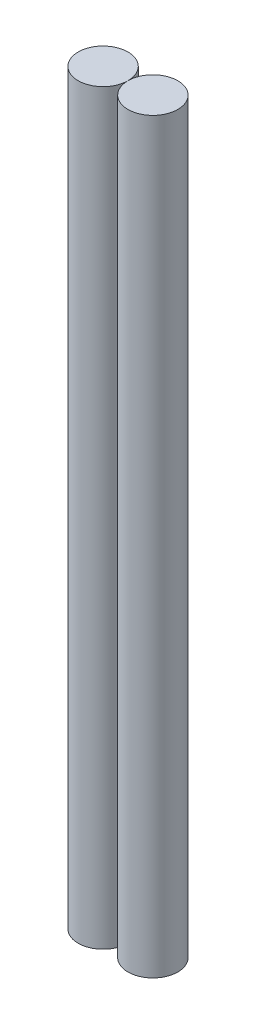
ISO-10303-21;
HEADER;
FILE_DESCRIPTION(('STEP AP214'),'2;1');
FILE_NAME('part.step','',(''),(''),'','','');
FILE_SCHEMA(('AUTOMOTIVE_DESIGN { 1 0 10303 214 1 1 1 1 }'));
ENDSEC;
DATA;
#1=APPLICATION_CONTEXT('core data for automotive mechanical design processes');
#2=APPLICATION_PROTOCOL_DEFINITION('international standard','automotive_design',2000,#1);
#3=PRODUCT_CONTEXT('',#1,'mechanical');
#4=PRODUCT('Part','Part','',(#3));
#5=PRODUCT_RELATED_PRODUCT_CATEGORY('part','',(#4));
#6=PRODUCT_DEFINITION_FORMATION('','',#4);
#7=PRODUCT_DEFINITION_CONTEXT('part definition',#1,'design');
#8=PRODUCT_DEFINITION('design','',#6,#7);
#9=PRODUCT_DEFINITION_SHAPE('','',#8);
#10=(LENGTH_UNIT() NAMED_UNIT(*) SI_UNIT(.MILLI.,.METRE.));
#11=(NAMED_UNIT(*) PLANE_ANGLE_UNIT() SI_UNIT($,.RADIAN.));
#12=(NAMED_UNIT(*) SI_UNIT($,.STERADIAN.) SOLID_ANGLE_UNIT());
#13=UNCERTAINTY_MEASURE_WITH_UNIT(LENGTH_MEASURE(1.E-05),#10,'distance_accuracy_value','');
#14=(GEOMETRIC_REPRESENTATION_CONTEXT(3) GLOBAL_UNCERTAINTY_ASSIGNED_CONTEXT((#13)) GLOBAL_UNIT_ASSIGNED_CONTEXT((#10,
#11,#12)) REPRESENTATION_CONTEXT('',''));
#15=CARTESIAN_POINT('',(0.,0.,0.));
#16=DIRECTION('',(0.,0.,1.));
#17=DIRECTION('',(1.,0.,0.));
#18=AXIS2_PLACEMENT_3D('',#15,#16,#17);
#19=CARTESIAN_POINT('',(0.,270.,0.));
#20=DIRECTION('',(0.,-1.,0.));
#21=DIRECTION('',(0.,0.,-1.));
#22=AXIS2_PLACEMENT_3D('',#19,#20,#21);
#23=CYLINDRICAL_SURFACE('',#22,9.);
#24=CARTESIAN_POINT('',(0.,270.,0.));
#25=DIRECTION('',(0.,1.,0.));
#26=DIRECTION('',(0.,0.,1.));
#27=AXIS2_PLACEMENT_3D('',#24,#25,#26);
#28=CIRCLE('',#27,9.);
#29=CARTESIAN_POINT('',(0.,270.,9.));
#30=VERTEX_POINT('',#29);
#31=EDGE_CURVE('E12',#30,#30,#28,.T.);
#32=ORIENTED_EDGE('',*,*,#31,.F.);
#33=EDGE_LOOP('',(#32));
#34=FACE_BOUND('',#33,.T.);
#35=CARTESIAN_POINT('',(0.,0.,0.));
#36=DIRECTION('',(0.,1.,0.));
#37=DIRECTION('',(0.,0.,1.));
#38=AXIS2_PLACEMENT_3D('',#35,#36,#37);
#39=CIRCLE('',#38,9.);
#40=CARTESIAN_POINT('',(0.,0.,9.));
#41=VERTEX_POINT('',#40);
#42=EDGE_CURVE('E52',#41,#41,#39,.T.);
#43=ORIENTED_EDGE('',*,*,#42,.T.);
#44=EDGE_LOOP('',(#43));
#45=FACE_BOUND('',#44,.T.);
#46=ADVANCED_FACE('F49',(#34,#45),#23,.T.);
#47=CARTESIAN_POINT('',(0.,270.,0.));
#48=DIRECTION('',(0.,1.,0.));
#49=DIRECTION('',(0.,0.,1.));
#50=AXIS2_PLACEMENT_3D('',#47,#48,#49);
#51=PLANE('',#50);
#52=ORIENTED_EDGE('',*,*,#31,.T.);
#53=EDGE_LOOP('',(#52));
#54=FACE_BOUND('',#53,.T.);
#55=ADVANCED_FACE('F64',(#54),#51,.T.);
#56=CARTESIAN_POINT('',(0.,0.,0.));
#57=DIRECTION('',(0.,1.,0.));
#58=DIRECTION('',(0.,0.,1.));
#59=AXIS2_PLACEMENT_3D('',#56,#57,#58);
#60=PLANE('',#59);
#61=ORIENTED_EDGE('',*,*,#42,.F.);
#62=EDGE_LOOP('',(#61));
#63=FACE_BOUND('',#62,.T.);
#64=ADVANCED_FACE('F62',(#63),#60,.F.);
#65=CLOSED_SHELL('',(#46,#55,#64));
#66=MANIFOLD_SOLID_BREP('B2',#65);
#67=CARTESIAN_POINT('',(18.,270.,0.));
#68=DIRECTION('',(0.,-1.,0.));
#69=DIRECTION('',(0.,0.,-1.));
#70=AXIS2_PLACEMENT_3D('',#67,#68,#69);
#71=CYLINDRICAL_SURFACE('',#70,9.00000000000001);
#72=CARTESIAN_POINT('',(18.,270.,0.));
#73=DIRECTION('',(0.,1.,0.));
#74=DIRECTION('',(0.,0.,1.));
#75=AXIS2_PLACEMENT_3D('',#72,#73,#74);
#76=CIRCLE('',#75,9.00000000000001);
#77=CARTESIAN_POINT('',(18.,270.,9.00000000000001));
#78=VERTEX_POINT('',#77);
#79=EDGE_CURVE('E48',#78,#78,#76,.T.);
#80=ORIENTED_EDGE('',*,*,#79,.F.);
#81=EDGE_LOOP('',(#80));
#82=FACE_BOUND('',#81,.T.);
#83=CARTESIAN_POINT('',(18.,0.,0.));
#84=DIRECTION('',(0.,1.,0.));
#85=DIRECTION('',(0.,0.,1.));
#86=AXIS2_PLACEMENT_3D('',#83,#84,#85);
#87=CIRCLE('',#86,9.00000000000001);
#88=CARTESIAN_POINT('',(18.,0.,9.00000000000001));
#89=VERTEX_POINT('',#88);
#90=EDGE_CURVE('E93',#89,#89,#87,.T.);
#91=ORIENTED_EDGE('',*,*,#90,.T.);
#92=EDGE_LOOP('',(#91));
#93=FACE_BOUND('',#92,.T.);
#94=ADVANCED_FACE('F90',(#82,#93),#71,.T.);
#95=CARTESIAN_POINT('',(0.,270.,0.));
#96=DIRECTION('',(0.,1.,0.));
#97=DIRECTION('',(0.,0.,1.));
#98=AXIS2_PLACEMENT_3D('',#95,#96,#97);
#99=PLANE('',#98);
#100=ORIENTED_EDGE('',*,*,#79,.T.);
#101=EDGE_LOOP('',(#100));
#102=FACE_BOUND('',#101,.T.);
#103=ADVANCED_FACE('F105',(#102),#99,.T.);
#104=CARTESIAN_POINT('',(0.,0.,0.));
#105=DIRECTION('',(0.,1.,0.));
#106=DIRECTION('',(0.,0.,1.));
#107=AXIS2_PLACEMENT_3D('',#104,#105,#106);
#108=PLANE('',#107);
#109=ORIENTED_EDGE('',*,*,#90,.F.);
#110=EDGE_LOOP('',(#109));
#111=FACE_BOUND('',#110,.T.);
#112=ADVANCED_FACE('F103',(#111),#108,.F.);
#113=CLOSED_SHELL('',(#94,#103,#112));
#114=MANIFOLD_SOLID_BREP('B7',#113);
#115=ADVANCED_BREP_SHAPE_REPRESENTATION('',(#18,#66,#114),#14);
#116=SHAPE_DEFINITION_REPRESENTATION(#9,#115);
ENDSEC;
END-ISO-10303-21;
